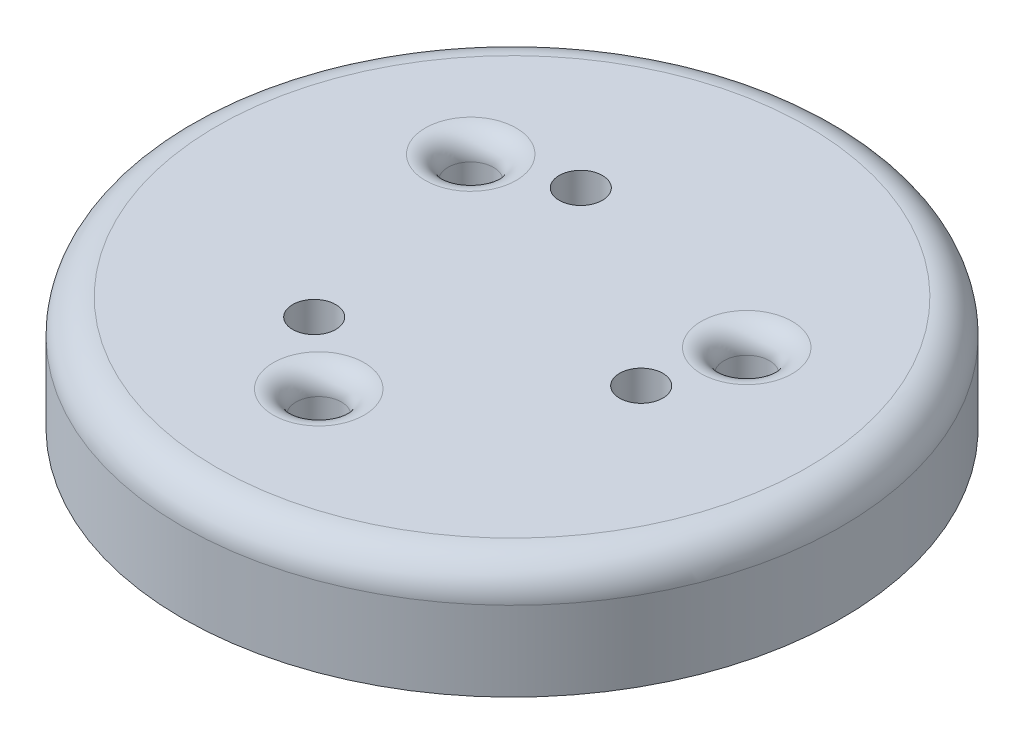
ISO-10303-21;
HEADER;
FILE_DESCRIPTION(('STEP AP214'),'2;1');
FILE_NAME('part.step','',(''),(''),'','','');
FILE_SCHEMA(('AUTOMOTIVE_DESIGN { 1 0 10303 214 1 1 1 1 }'));
ENDSEC;
DATA;
#1=APPLICATION_CONTEXT('core data for automotive mechanical design processes');
#2=APPLICATION_PROTOCOL_DEFINITION('international standard','automotive_design',2000,#1);
#3=PRODUCT_CONTEXT('',#1,'mechanical');
#4=PRODUCT('Part','Part','',(#3));
#5=PRODUCT_RELATED_PRODUCT_CATEGORY('part','',(#4));
#6=PRODUCT_DEFINITION_FORMATION('','',#4);
#7=PRODUCT_DEFINITION_CONTEXT('part definition',#1,'design');
#8=PRODUCT_DEFINITION('design','',#6,#7);
#9=PRODUCT_DEFINITION_SHAPE('','',#8);
#10=(LENGTH_UNIT() NAMED_UNIT(*) SI_UNIT(.MILLI.,.METRE.));
#11=(NAMED_UNIT(*) PLANE_ANGLE_UNIT() SI_UNIT($,.RADIAN.));
#12=(NAMED_UNIT(*) SI_UNIT($,.STERADIAN.) SOLID_ANGLE_UNIT());
#13=UNCERTAINTY_MEASURE_WITH_UNIT(LENGTH_MEASURE(1.E-05),#10,'distance_accuracy_value','');
#14=(GEOMETRIC_REPRESENTATION_CONTEXT(3) GLOBAL_UNCERTAINTY_ASSIGNED_CONTEXT((#13)) GLOBAL_UNIT_ASSIGNED_CONTEXT((#10,
#11,#12)) REPRESENTATION_CONTEXT('',''));
#15=CARTESIAN_POINT('',(0.,0.,0.));
#16=DIRECTION('',(0.,0.,1.));
#17=DIRECTION('',(1.,0.,0.));
#18=AXIS2_PLACEMENT_3D('',#15,#16,#17);
#19=CARTESIAN_POINT('',(-0.747043708746109,-3.5,7.75834555154788));
#20=DIRECTION('',(0.,1.,0.));
#21=DIRECTION('',(0.,0.,1.));
#22=AXIS2_PLACEMENT_3D('',#19,#20,#21);
#23=CYLINDRICAL_SURFACE('',#22,2.40000000000027);
#24=DIRECTION('',(0.,1.,0.));
#25=VECTOR('',#24,1.);
#26=CARTESIAN_POINT('',(-2.94898575184642,-3.75,6.80364599732755));
#27=LINE('',#26,#25);
#28=CARTESIAN_POINT('',(-2.94898575184642,-3.5,6.80364599732755));
#29=VERTEX_POINT('',#28);
#30=CARTESIAN_POINT('',(-2.94898575184642,0.499999999999999,6.80364599732755));
#31=VERTEX_POINT('',#30);
#32=EDGE_CURVE('E115',#29,#31,#27,.T.);
#33=ORIENTED_EDGE('',*,*,#32,.F.);
#34=CARTESIAN_POINT('',(-0.747043708746109,-3.5,7.75834555154788));
#35=DIRECTION('',(0.,-1.,0.));
#36=DIRECTION('',(0.,0.,-1.));
#37=AXIS2_PLACEMENT_3D('',#34,#35,#36);
#38=CIRCLE('',#37,2.40000000000027);
#39=CARTESIAN_POINT('',(-1.85916700968341,-3.5,5.63156823280631));
#40=VERTEX_POINT('',#39);
#41=EDGE_CURVE('E125',#40,#29,#38,.T.);
#42=ORIENTED_EDGE('',*,*,#41,.F.);
#43=DIRECTION('',(0.,1.,0.));
#44=VECTOR('',#43,1.);
#45=CARTESIAN_POINT('',(-1.85916700968341,-3.75,5.63156823280631));
#46=LINE('',#45,#44);
#47=CARTESIAN_POINT('',(-1.85916700968341,0.5,5.63156823280631));
#48=VERTEX_POINT('',#47);
#49=EDGE_CURVE('E117',#48,#40,#46,.F.);
#50=ORIENTED_EDGE('',*,*,#49,.F.);
#51=CARTESIAN_POINT('',(-1.85916700968341,0.5,5.63156823280631));
#52=CARTESIAN_POINT('',(-1.85922399324341,0.476364152434353,5.63160982479117));
#53=CARTESIAN_POINT('',(-1.85710085481181,0.452819889741292,5.6304870864629));
#54=CARTESIAN_POINT('',(-1.84903628313936,0.406824915444279,5.62629371613808));
#55=CARTESIAN_POINT('',(-1.84313653899929,0.38436510889328,5.62324435640042));
#56=CARTESIAN_POINT('',(-1.82807390600251,0.34100557497745,5.6155809974768));
#57=CARTESIAN_POINT('',(-1.81892577377205,0.320099301315876,5.61097407835637));
#58=CARTESIAN_POINT('',(-1.79792325712642,0.279937041822302,5.60061735653464));
#59=CARTESIAN_POINT('',(-1.78605989142544,0.260686831264544,5.59486376930435));
#60=CARTESIAN_POINT('',(-1.75422420588657,0.215699527903121,5.57980940749695));
#61=CARTESIAN_POINT('',(-1.73301416670765,0.190979033457974,5.57008318135522));
#62=CARTESIAN_POINT('',(-1.68693258784869,0.14558463512192,5.54989712614965));
#63=CARTESIAN_POINT('',(-1.66205632415581,0.12491603347054,5.53943635985756));
#64=CARTESIAN_POINT('',(-1.60893980039056,0.0876034545915592,5.51826431890485));
#65=CARTESIAN_POINT('',(-1.58065570854353,0.0710226777879334,5.50755161705734));
#66=CARTESIAN_POINT('',(-1.52166195539404,0.0427147185961175,5.48657434228855));
#67=CARTESIAN_POINT('',(-1.49095727822847,0.0309778578931878,5.47630891279046));
#68=CARTESIAN_POINT('',(-1.43451062158264,0.0147856943271084,5.45876659369856));
#69=CARTESIAN_POINT('',(-1.40911281423456,0.009309628856281,5.45132027870981));
#70=CARTESIAN_POINT('',(-1.3575570049761,0.00191082490389715,5.43713853922088));
#71=CARTESIAN_POINT('',(-1.33139751007746,-4.38044167560807E-06,5.43040465018355));
#72=CARTESIAN_POINT('',(-1.30508833867296,0.,5.42412486981895));
#73=B_SPLINE_CURVE_WITH_KNOTS('',3,(#51,#52,#53,#54,#55,#56,#57,#58,#59,#60,#61,#62,#63,#64,#65,
#66,#67,#68,#69,#70,#71,#72),.UNSPECIFIED.,.F.,.F.,(4,2,2,2,2,2,2,2,2,2,4),(0.,
0.0706410156258254,0.140515381349497,0.210076302649046,0.279870726590837,0.381312836900307,
0.482886819341663,0.585944554177381,0.688795367339838,0.769635628118746,0.850646715821537),.UNSPECIFIED.);
#74=CARTESIAN_POINT('',(-1.30508833867296,0.,5.42412486981895));
#75=VERTEX_POINT('',#74);
#76=EDGE_CURVE('E209',#48,#75,#73,.T.);
#77=ORIENTED_EDGE('',*,*,#76,.T.);
#78=CARTESIAN_POINT('',(-0.747043708746109,0.,7.75834555154788));
#79=DIRECTION('',(0.,-1.,0.));
#80=DIRECTION('',(0.,0.,-1.));
#81=AXIS2_PLACEMENT_3D('',#78,#79,#80);
#82=CIRCLE('',#81,2.40000000000027);
#83=CARTESIAN_POINT('',(-3.11563368180199,0.,7.37132935093037));
#84=VERTEX_POINT('',#83);
#85=EDGE_CURVE('E134',#75,#84,#82,.T.);
#86=ORIENTED_EDGE('',*,*,#85,.T.);
#87=CARTESIAN_POINT('',(-3.11563368180199,0.,7.37132935093037));
#88=CARTESIAN_POINT('',(-3.1101504548428,-9.42250793291496E-06,7.33762045277867));
#89=CARTESIAN_POINT('',(-3.10391373088185,0.00304512877975931,7.30411718324805));
#90=CARTESIAN_POINT('',(-3.09029956792461,0.0147093829560167,7.23850151742084));
#91=CARTESIAN_POINT('',(-3.08292805148638,0.0232909409952881,7.20638294910039));
#92=CARTESIAN_POINT('',(-3.06736894792823,0.0454182683123219,7.14424113943873));
#93=CARTESIAN_POINT('',(-3.05918355755489,0.0589509253297983,7.11421261069181));
#94=CARTESIAN_POINT('',(-3.0423763398629,0.0905630374124857,7.05667117236412));
#95=CARTESIAN_POINT('',(-3.0337533331852,0.108655363864944,7.02916568999036));
#96=CARTESIAN_POINT('',(-3.01585812059544,0.15076645104049,6.97517421708824));
#97=CARTESIAN_POINT('',(-3.00659334910579,0.175159334478642,6.94897580327789));
#98=CARTESIAN_POINT('',(-2.9890261823897,0.228635720743396,6.90151944014422));
#99=CARTESIAN_POINT('',(-2.98072116502593,0.2577058979614,6.88024786228619));
#100=CARTESIAN_POINT('',(-2.96904012572221,0.308226405020023,6.85121993047369));
#101=CARTESIAN_POINT('',(-2.96499330720332,0.32834364364927,6.84140513937073));
#102=CARTESIAN_POINT('',(-2.95809096705968,0.369973446112554,6.82488415821906));
#103=CARTESIAN_POINT('',(-2.95523158105399,0.391481216241625,6.81816787633649));
#104=CARTESIAN_POINT('',(-2.95177890716333,0.427586612901112,6.81010773432918));
#105=CARTESIAN_POINT('',(-2.95074104060405,0.441909733364196,6.80770188368661));
#106=CARTESIAN_POINT('',(-2.94934013629236,0.470816525011653,6.80446330041692));
#107=CARTESIAN_POINT('',(-2.94897955620156,0.48540095196511,6.80363629675652));
#108=CARTESIAN_POINT('',(-2.94898575184642,0.5,6.80364599732756));
#109=B_SPLINE_CURVE_WITH_KNOTS('',3,(#87,#88,#89,#90,#91,#92,#93,#94,#95,#96,#97,#98,#99,#100,
#101,#102,#103,#104,#105,#106,#107,#108),.UNSPECIFIED.,.F.,.F.,(4,2,2,2,2,2,2,2,2,2,4),(0.,
0.102193868356032,0.203871411888512,0.305281603827198,0.406981335110916,0.517364626536822,
0.627438830246796,0.695450836911381,0.763239737075119,0.806825724473092,0.850569568566294),.UNSPECIFIED.);
#110=EDGE_CURVE('E128',#84,#31,#109,.T.);
#111=ORIENTED_EDGE('',*,*,#110,.T.);
#112=EDGE_LOOP('',(#33,#42,#50,#77,#86,#111));
#113=FACE_BOUND('',#112,.T.);
#114=ADVANCED_FACE('F40',(#113),#23,.T.);
#115=CARTESIAN_POINT('',(7.09244619335151,-3.5,-3.23221394626247));
#116=DIRECTION('',(0.,1.,0.));
#117=DIRECTION('',(0.,0.,1.));
#118=AXIS2_PLACEMENT_3D('',#115,#116,#117);
#119=CYLINDRICAL_SURFACE('',#118,2.4);
#120=DIRECTION('',(0.,1.,0.));
#121=VECTOR('',#120,1.);
#122=CARTESIAN_POINT('',(7.36662314796493,-3.75,-0.847926422166663));
#123=LINE('',#122,#121);
#124=CARTESIAN_POINT('',(7.36662314796493,-3.5,-0.847926422166663));
#125=VERTEX_POINT('',#124);
#126=CARTESIAN_POINT('',(7.36662314796493,0.499999999999998,-0.847926422166663));
#127=VERTEX_POINT('',#126);
#128=EDGE_CURVE('E479',#125,#127,#123,.T.);
#129=ORIENTED_EDGE('',*,*,#128,.F.);
#130=CARTESIAN_POINT('',(7.09244619335151,-3.5,-3.23221394626247));
#131=DIRECTION('',(0.,-1.,0.));
#132=DIRECTION('',(0.,0.,-1.));
#133=AXIS2_PLACEMENT_3D('',#130,#131,#132);
#134=CIRCLE('',#133,2.4);
#135=CARTESIAN_POINT('',(5.80666465759774,-3.5,-1.20569825613948));
#136=VERTEX_POINT('',#135);
#137=EDGE_CURVE('E145',#136,#125,#134,.T.);
#138=ORIENTED_EDGE('',*,*,#137,.F.);
#139=DIRECTION('',(0.,1.,0.));
#140=VECTOR('',#139,1.);
#141=CARTESIAN_POINT('',(5.80666465759774,-3.75,-1.20569825613948));
#142=LINE('',#141,#140);
#143=CARTESIAN_POINT('',(5.80666465759774,0.5,-1.20569825613948));
#144=VERTEX_POINT('',#143);
#145=EDGE_CURVE('E476',#144,#136,#142,.F.);
#146=ORIENTED_EDGE('',*,*,#145,.F.);
#147=CARTESIAN_POINT('',(5.80666465759774,0.5,-1.20569825613948));
#148=CARTESIAN_POINT('',(5.80672916909323,0.476364152434356,-1.20566970292135));
#149=CARTESIAN_POINT('',(5.80469527996334,0.452819889741298,-1.20694702557473));
#150=CARTESIAN_POINT('',(5.79703142889834,0.406824915444291,-1.2118344643513));
#151=CARTESIAN_POINT('',(5.79144073383021,0.384365108893295,-1.21541911278361));
#152=CARTESIAN_POINT('',(5.77727275382566,0.341005574977471,-1.22463205614489));
#153=CARTESIAN_POINT('',(5.76870897871895,0.320099301315901,-1.23025111149342));
#154=CARTESIAN_POINT('',(5.74923853619859,0.279937041822333,-1.24326146354108));
#155=CARTESIAN_POINT('',(5.73832410064378,0.260686831264578,-1.25065864599737));
#156=CARTESIAN_POINT('',(5.70936879811137,0.215699527903155,-1.27070197751721));
#157=CARTESIAN_POINT('',(5.69034061960022,0.190979033458005,-1.28420729719056));
#158=CARTESIAN_POINT('',(5.6498181935605,0.145584635121947,-1.31402208752613));
#159=CARTESIAN_POINT('',(5.62832077236206,0.124916033470564,-1.33033518068936));
#160=CARTESIAN_POINT('',(5.58342698516441,0.0876034545915787,-1.36574941915444));
#161=CARTESIAN_POINT('',(5.56000746729779,0.07102267778795,-1.38488781029318));
#162=CARTESIAN_POINT('',(5.5123437378711,0.0427147185961288,-1.42548926180084));
#163=CARTESIAN_POINT('',(5.4881012765622,0.0309778578931968,-1.44694757749218));
#164=CARTESIAN_POINT('',(5.4446858542644,0.0147856943271131,-1.48706065656022));
#165=CARTESIAN_POINT('',(5.42553825264552,0.00930962885628393,-1.5053326454297));
#166=CARTESIAN_POINT('',(5.38747860134901,0.00191082490389742,-1.54289041621574));
#167=CARTESIAN_POINT('',(5.36856713492708,-4.38044167611641E-06,-1.56217825882947));
#168=CARTESIAN_POINT('',(5.3499740998989,0.,-1.58182277943599));
#169=B_SPLINE_CURVE_WITH_KNOTS('',3,(#147,#148,#149,#150,#151,#152,#153,#154,#155,#156,#157,
#158,#159,#160,#161,#162,#163,#164,#165,#166,#167,#168),.UNSPECIFIED.,.F.,.F.,(4,2,2,2,2,2,2,2,
2,2,4),(0.,0.0706410156258162,0.140515381349479,0.210076302649019,0.279870726590799,
0.381312836900282,0.482886819341651,0.585944554177385,0.688795367339857,0.769635628118784,
0.850646715821595),.UNSPECIFIED.);
#170=CARTESIAN_POINT('',(5.3499740998989,0.,-1.58182277943599));
#171=VERTEX_POINT('',#170);
#172=EDGE_CURVE('E242',#144,#171,#169,.T.);
#173=ORIENTED_EDGE('',*,*,#172,.T.);
#174=CARTESIAN_POINT('',(7.09244619335151,0.,-3.23221394626247));
#175=DIRECTION('',(0.,-1.,0.));
#176=DIRECTION('',(0.,0.,-1.));
#177=AXIS2_PLACEMENT_3D('',#174,#175,#176);
#178=CIRCLE('',#177,2.4);
#179=CARTESIAN_POINT('',(7.94157531846838,0.,-0.987446758138442));
#180=VERTEX_POINT('',#179);
#181=EDGE_CURVE('E150',#171,#180,#178,.T.);
#182=ORIENTED_EDGE('',*,*,#181,.T.);
#183=CARTESIAN_POINT('',(7.94157531846838,0.,-0.987446758138442));
#184=CARTESIAN_POINT('',(7.90964094285583,-9.42250793316037E-06,-0.97534092290397));
#185=CARTESIAN_POINT('',(7.87750789835199,0.00304512877975952,-0.963990449525229));
#186=CARTESIAN_POINT('',(7.81387598338077,0.0147093829560188,-0.942972827583861));
#187=CARTESIAN_POINT('',(7.78237472906296,0.0232909409952914,-0.933297463923552));
#188=CARTESIAN_POINT('',(7.72077879147973,0.0454182683123283,-0.915701138034194));
#189=CARTESIAN_POINT('',(7.69068062755995,0.0589509253298065,-0.907775629663939));
#190=CARTESIAN_POINT('',(7.63244467135187,0.0905630374124975,-0.89356038798829));
#191=CARTESIAN_POINT('',(7.60431272153399,0.108655363864958,-0.887275389641311));
#192=CARTESIAN_POINT('',(7.54860712811813,0.15076645104051,-0.875777361899105));
#193=CARTESIAN_POINT('',(7.52128625047468,0.175159334478666,-0.870701682464221));
#194=CARTESIAN_POINT('',(7.47140425107164,0.228635720743431,-0.862187113546037));
#195=CARTESIAN_POINT('',(7.44883001558611,0.257705897961442,-0.858743680632926));
#196=CARTESIAN_POINT('',(7.41785056956531,0.308226405020069,-0.8543457915063));
#197=CARTESIAN_POINT('',(7.40732730187786,0.328343643649311,-0.852943043596693));
#198=CARTESIAN_POINT('',(7.38956854243325,0.369973446112587,-0.850660154930812));
#199=CARTESIAN_POINT('',(7.38232237870113,0.391481216241655,-0.849778314909683));
#200=CARTESIAN_POINT('',(7.37361575401936,0.427586612901133,-0.848738347206322));
#201=CARTESIAN_POINT('',(7.37101329296554,0.441909733364212,-0.848434240691103));
#202=CARTESIAN_POINT('',(7.36750814542588,0.470816525011661,-0.848028167778463));
#203=CARTESIAN_POINT('',(7.36661164920155,0.485400951965114,-0.847926937466996));
#204=CARTESIAN_POINT('',(7.36662314796493,0.5,-0.847926422166664));
#205=B_SPLINE_CURVE_WITH_KNOTS('',3,(#183,#184,#185,#186,#187,#188,#189,#190,#191,#192,#193,
#194,#195,#196,#197,#198,#199,#200,#201,#202,#203,#204),.UNSPECIFIED.,.F.,.F.,(4,2,2,2,2,2,2,2,
2,2,4),(0.,0.102193868356048,0.203871411888543,0.305281603827245,0.406981335110977,
0.517364626536908,0.627438830246908,0.695450836911478,0.763239737075204,0.806825724473164,
0.850569568566353),.UNSPECIFIED.);
#206=EDGE_CURVE('E248',#180,#127,#205,.T.);
#207=ORIENTED_EDGE('',*,*,#206,.T.);
#208=EDGE_LOOP('',(#129,#138,#146,#173,#182,#207));
#209=FACE_BOUND('',#208,.T.);
#210=ADVANCED_FACE('F260',(#209),#119,.T.);
#211=CARTESIAN_POINT('',(-6.3454024846054,-3.5,-4.52613160528542));
#212=DIRECTION('',(0.,1.,0.));
#213=DIRECTION('',(0.,0.,1.));
#214=AXIS2_PLACEMENT_3D('',#211,#212,#213);
#215=CYLINDRICAL_SURFACE('',#214,2.40000000000008);
#216=DIRECTION('',(0.,1.,0.));
#217=VECTOR('',#216,1.);
#218=CARTESIAN_POINT('',(-4.41763739611885,-2.25,-5.95571957516094));
#219=LINE('',#218,#217);
#220=CARTESIAN_POINT('',(-4.41763739611885,-3.5,-5.95571957516094));
#221=VERTEX_POINT('',#220);
#222=CARTESIAN_POINT('',(-4.41763739611885,0.5,-5.95571957516094));
#223=VERTEX_POINT('',#222);
#224=EDGE_CURVE('E63',#221,#223,#219,.T.);
#225=ORIENTED_EDGE('',*,*,#224,.F.);
#226=CARTESIAN_POINT('',(-6.3454024846054,-3.5,-4.52613160528542));
#227=DIRECTION('',(0.,-1.,0.));
#228=DIRECTION('',(0.,0.,1.));
#229=AXIS2_PLACEMENT_3D('',#226,#227,#228);
#230=CIRCLE('',#229,2.40000000000008);
#231=CARTESIAN_POINT('',(-3.94749764791417,-3.5,-4.42586997666704));
#232=VERTEX_POINT('',#231);
#233=EDGE_CURVE('E137',#232,#221,#230,.T.);
#234=ORIENTED_EDGE('',*,*,#233,.F.);
#235=DIRECTION('',(0.,1.,0.));
#236=VECTOR('',#235,1.);
#237=CARTESIAN_POINT('',(-3.94749764791417,-2.25,-4.42586997666704));
#238=LINE('',#237,#236);
#239=CARTESIAN_POINT('',(-3.94749764791417,0.5,-4.42586997666704));
#240=VERTEX_POINT('',#239);
#241=EDGE_CURVE('E55',#240,#232,#238,.F.);
#242=ORIENTED_EDGE('',*,*,#241,.F.);
#243=CARTESIAN_POINT('',(-3.94749764791417,0.5,-4.42586997666704));
#244=CARTESIAN_POINT('',(-3.94750517584966,0.476364152434354,-4.42594012187004));
#245=CARTESIAN_POINT('',(-3.94759442515137,0.452819889741294,-4.42354006088838));
#246=CARTESIAN_POINT('',(-3.94799514575883,0.406824915444284,-4.41445925178699));
#247=CARTESIAN_POINT('',(-3.94830419483077,0.384365108893288,-4.40782524361703));
#248=CARTESIAN_POINT('',(-3.94919884782299,0.34100557497746,-4.39094894133213));
#249=CARTESIAN_POINT('',(-3.94978320494674,0.320099301315888,-4.38072296686315));
#250=CARTESIAN_POINT('',(-3.95131527907202,0.279937041822317,-4.35735589299377));
#251=CARTESIAN_POINT('',(-3.95226420921818,0.26068683126456,-4.34420512330719));
#252=CARTESIAN_POINT('',(-3.95514459222464,0.215699527903138,-4.30910742997994));
#253=CARTESIAN_POINT('',(-3.95732645289241,0.190979033457989,-4.28587588416486));
#254=CARTESIAN_POINT('',(-3.96288560571167,0.145584635121933,-4.23587503862371));
#255=CARTESIAN_POINT('',(-3.96626444820611,0.124916033470551,-4.20910117916839));
#256=CARTESIAN_POINT('',(-3.97448718477372,0.0876034545915679,-4.1525148997506));
#257=CARTESIAN_POINT('',(-3.97935175875413,0.0710226777879407,-4.12266380676435));
#258=CARTESIAN_POINT('',(-3.99068178247693,0.0427147185961223,-4.06108508048791));
#259=CARTESIAN_POINT('',(-3.99714399833362,0.0309778578931916,-4.02936133529847));
#260=CARTESIAN_POINT('',(-4.01017523268165,0.0147856943271102,-3.97170593713853));
#261=CARTESIAN_POINT('',(-4.01642543841085,0.00930962885628205,-3.9459876332803));
#262=CARTESIAN_POINT('',(-4.02992159637281,0.00191082490389709,-3.89424812300533));
#263=CARTESIAN_POINT('',(-4.03716962484954,-4.38044167599041E-06,-3.86822639135427));
#264=CARTESIAN_POINT('',(-4.04488576122586,0.,-3.84230209038315));
#265=B_SPLINE_CURVE_WITH_KNOTS('',3,(#243,#244,#245,#246,#247,#248,#249,#250,#251,#252,#253,
#254,#255,#256,#257,#258,#259,#260,#261,#262,#263,#264),.UNSPECIFIED.,.F.,.F.,(4,2,2,2,2,2,2,2,
2,2,4),(0.,0.070641015625821,0.140515381349488,0.210076302649033,0.279870726590819,
0.381312836900295,0.482886819341658,0.585944554177385,0.688795367339848,0.769635628118766,
0.850646715821566),.UNSPECIFIED.);
#266=CARTESIAN_POINT('',(-4.04488576122586,0.,-3.84230209038315));
#267=VERTEX_POINT('',#266);
#268=EDGE_CURVE('E254',#240,#267,#265,.T.);
#269=ORIENTED_EDGE('',*,*,#268,.T.);
#270=CARTESIAN_POINT('',(-6.3454024846054,0.,-4.52613160528542));
#271=DIRECTION('',(0.,-1.,0.));
#272=DIRECTION('',(0.,0.,1.));
#273=AXIS2_PLACEMENT_3D('',#270,#271,#272);
#274=CIRCLE('',#273,2.40000000000008);
#275=CARTESIAN_POINT('',(-4.82594163666666,0.,-6.383882592792));
#276=VERTEX_POINT('',#275);
#277=EDGE_CURVE('E133',#267,#276,#274,.T.);
#278=ORIENTED_EDGE('',*,*,#277,.T.);
#279=CARTESIAN_POINT('',(-4.82594163666666,0.,-6.383882592792));
#280=CARTESIAN_POINT('',(-4.7994904880133,-9.42250793285505E-06,-6.36227952987477));
#281=CARTESIAN_POINT('',(-4.77359416747042,0.00304512877975951,-6.34012673372288));
#282=CARTESIAN_POINT('',(-4.72357641545645,0.0147093829560176,-6.29552868983704));
#283=CARTESIAN_POINT('',(-4.69944667757686,0.0232909409952896,-6.2730854851769));
#284=CARTESIAN_POINT('',(-4.6534098435518,0.045418268312325,-6.22854000140459));
#285=CARTESIAN_POINT('',(-4.63149707000536,0.0589509253298024,-6.20643698102792));
#286=CARTESIAN_POINT('',(-4.59006833148927,0.0905630374124917,-6.16311078437588));
#287=CARTESIAN_POINT('',(-4.57055938834911,0.108655363864951,-6.1418903003491));
#288=CARTESIAN_POINT('',(-4.53274900752301,0.1507664510405,-6.09939685518918));
#289=CARTESIAN_POINT('',(-4.51469290136921,0.175159334478654,-6.07827412081371));
#290=CARTESIAN_POINT('',(-4.48237806868227,0.228635720743413,-6.03933232659822));
#291=CARTESIAN_POINT('',(-4.46810885056053,0.25770589796142,-6.0215041816533));
#292=CARTESIAN_POINT('',(-4.44881044384344,0.308226405020044,-5.99687413896743));
#293=CARTESIAN_POINT('',(-4.44233399467489,0.328343643649289,-5.98846209577408));
#294=CARTESIAN_POINT('',(-4.43147757537392,0.369973446112569,-5.97422400328829));
#295=CARTESIAN_POINT('',(-4.42709079764749,0.391481216241638,-5.96838956142685));
#296=CARTESIAN_POINT('',(-4.42183684685638,0.427586612901121,-5.9613693871229));
#297=CARTESIAN_POINT('',(-4.42027225236183,0.441909733364202,-5.95926764299555));
#298=CARTESIAN_POINT('',(-4.41816800913386,0.470816525011656,-5.95643513263851));
#299=CARTESIAN_POINT('',(-4.41763209300033,0.485400951965112,-5.95570935928957));
#300=CARTESIAN_POINT('',(-4.41763739611885,0.5,-5.95571957516094));
#301=B_SPLINE_CURVE_WITH_KNOTS('',3,(#279,#280,#281,#282,#283,#284,#285,#286,#287,#288,#289,
#290,#291,#292,#293,#294,#295,#296,#297,#298,#299,#300),.UNSPECIFIED.,.F.,.F.,(4,2,2,2,2,2,2,2,
2,2,4),(0.,0.102193868356038,0.203871411888527,0.305281603827221,0.406981335110945,
0.517364626536863,0.627438830246849,0.695450836911427,0.763239737075158,0.806825724473126,
0.850569568566322),.UNSPECIFIED.);
#302=EDGE_CURVE('E438',#276,#223,#301,.T.);
#303=ORIENTED_EDGE('',*,*,#302,.T.);
#304=EDGE_LOOP('',(#225,#234,#242,#269,#278,#303));
#305=FACE_BOUND('',#304,.T.);
#306=ADVANCED_FACE('F265',(#305),#215,.T.);
#307=CARTESIAN_POINT('',(6.22621686307341,5.,0.544723392172865));
#308=DIRECTION('',(0.,-1.,0.));
#309=DIRECTION('',(0.,0.,-1.));
#310=AXIS2_PLACEMENT_3D('',#307,#308,#309);
#311=CYLINDRICAL_SURFACE('',#310,0.949999999999999);
#312=CARTESIAN_POINT('',(6.22621686307341,5.,0.544723392172865));
#313=DIRECTION('',(0.,1.,0.));
#314=DIRECTION('',(0.,0.,1.));
#315=AXIS2_PLACEMENT_3D('',#312,#313,#314);
#316=CIRCLE('',#315,0.949999999999999);
#317=CARTESIAN_POINT('',(6.22621686307341,5.,1.49472339217286));
#318=VERTEX_POINT('',#317);
#319=EDGE_CURVE('E171',#318,#318,#316,.T.);
#320=ORIENTED_EDGE('',*,*,#319,.T.);
#321=EDGE_LOOP('',(#320));
#322=FACE_BOUND('',#321,.T.);
#323=CARTESIAN_POINT('',(6.22621686307341,2.,0.544723392172865));
#324=DIRECTION('',(0.,-1.,0.));
#325=DIRECTION('',(0.,0.,-1.));
#326=AXIS2_PLACEMENT_3D('',#323,#324,#325);
#327=CIRCLE('',#326,0.949999999999999);
#328=CARTESIAN_POINT('',(6.22621686307341,2.,-0.405276607827134));
#329=VERTEX_POINT('',#328);
#330=EDGE_CURVE('E156',#329,#329,#327,.T.);
#331=ORIENTED_EDGE('',*,*,#330,.T.);
#332=EDGE_LOOP('',(#331));
#333=FACE_BOUND('',#332,.T.);
#334=ADVANCED_FACE('F300',(#322,#333),#311,.F.);
#335=CARTESIAN_POINT('',(-2.6413641358794,5.,-5.66442366897905));
#336=DIRECTION('',(0.,-1.,0.));
#337=DIRECTION('',(0.,0.,-1.));
#338=AXIS2_PLACEMENT_3D('',#335,#336,#337);
#339=CYLINDRICAL_SURFACE('',#338,0.950000000000001);
#340=CARTESIAN_POINT('',(-2.6413641358794,5.,-5.66442366897905));
#341=DIRECTION('',(0.,1.,0.));
#342=DIRECTION('',(0.,0.,1.));
#343=AXIS2_PLACEMENT_3D('',#340,#341,#342);
#344=CIRCLE('',#343,0.950000000000001);
#345=CARTESIAN_POINT('',(-2.6413641358794,5.,-4.71442366897905));
#346=VERTEX_POINT('',#345);
#347=EDGE_CURVE('E168',#346,#346,#344,.T.);
#348=ORIENTED_EDGE('',*,*,#347,.T.);
#349=EDGE_LOOP('',(#348));
#350=FACE_BOUND('',#349,.T.);
#351=CARTESIAN_POINT('',(-2.6413641358794,2.,-5.66442366897905));
#352=DIRECTION('',(0.,-1.,0.));
#353=DIRECTION('',(0.,0.,-1.));
#354=AXIS2_PLACEMENT_3D('',#351,#352,#353);
#355=CIRCLE('',#354,0.950000000000001);
#356=CARTESIAN_POINT('',(-2.6413641358794,2.,-6.61442366897905));
#357=VERTEX_POINT('',#356);
#358=EDGE_CURVE('E160',#357,#357,#355,.T.);
#359=ORIENTED_EDGE('',*,*,#358,.T.);
#360=EDGE_LOOP('',(#359));
#361=FACE_BOUND('',#360,.T.);
#362=ADVANCED_FACE('F296',(#350,#361),#339,.F.);
#363=CARTESIAN_POINT('',(-3.58485272719406,5.,5.11970027680618));
#364=DIRECTION('',(0.,-1.,0.));
#365=DIRECTION('',(0.,0.,-1.));
#366=AXIS2_PLACEMENT_3D('',#363,#364,#365);
#367=CYLINDRICAL_SURFACE('',#366,0.950000000000001);
#368=CARTESIAN_POINT('',(-3.58485272719406,5.,5.11970027680618));
#369=DIRECTION('',(0.,1.,0.));
#370=DIRECTION('',(0.,0.,1.));
#371=AXIS2_PLACEMENT_3D('',#368,#369,#370);
#372=CIRCLE('',#371,0.950000000000001);
#373=CARTESIAN_POINT('',(-3.58485272719406,5.,6.06970027680618));
#374=VERTEX_POINT('',#373);
#375=EDGE_CURVE('E165',#374,#374,#372,.T.);
#376=ORIENTED_EDGE('',*,*,#375,.T.);
#377=EDGE_LOOP('',(#376));
#378=FACE_BOUND('',#377,.T.);
#379=CARTESIAN_POINT('',(-3.58485272719406,2.,5.11970027680618));
#380=DIRECTION('',(0.,-1.,0.));
#381=DIRECTION('',(0.,0.,-1.));
#382=AXIS2_PLACEMENT_3D('',#379,#380,#381);
#383=CIRCLE('',#382,0.950000000000001);
#384=CARTESIAN_POINT('',(-3.58485272719406,2.,4.16970027680618));
#385=VERTEX_POINT('',#384);
#386=EDGE_CURVE('E164',#385,#385,#383,.T.);
#387=ORIENTED_EDGE('',*,*,#386,.T.);
#388=EDGE_LOOP('',(#387));
#389=FACE_BOUND('',#388,.T.);
#390=ADVANCED_FACE('F292',(#378,#389),#367,.F.);
#391=CARTESIAN_POINT('',(0.,5.,0.));
#392=DIRECTION('',(0.,1.,0.));
#393=DIRECTION('',(0.,0.,1.));
#394=AXIS2_PLACEMENT_3D('',#391,#392,#393);
#395=PLANE('',#394);
#396=CARTESIAN_POINT('',(-0.747043708746109,5.,7.75834555154788));
#397=DIRECTION('',(0.,1.,0.));
#398=DIRECTION('',(0.,0.,1.));
#399=AXIS2_PLACEMENT_3D('',#396,#397,#398);
#400=CIRCLE('',#399,2.);
#401=CARTESIAN_POINT('',(-0.747043708746109,5.,9.75834555154788));
#402=VERTEX_POINT('',#401);
#403=EDGE_CURVE('E441',#402,#402,#400,.F.);
#404=ORIENTED_EDGE('',*,*,#403,.T.);
#405=EDGE_LOOP('',(#404));
#406=FACE_BOUND('',#405,.T.);
#407=CARTESIAN_POINT('',(-6.3454024846054,5.,-4.52613160528542));
#408=DIRECTION('',(0.,1.,0.));
#409=DIRECTION('',(0.,0.,1.));
#410=AXIS2_PLACEMENT_3D('',#407,#408,#409);
#411=CIRCLE('',#410,2.);
#412=CARTESIAN_POINT('',(-6.3454024846054,5.,-2.52613160528542));
#413=VERTEX_POINT('',#412);
#414=EDGE_CURVE('E437',#413,#413,#411,.F.);
#415=ORIENTED_EDGE('',*,*,#414,.T.);
#416=EDGE_LOOP('',(#415));
#417=FACE_BOUND('',#416,.T.);
#418=CARTESIAN_POINT('',(7.09244619335151,5.,-3.23221394626247));
#419=DIRECTION('',(0.,1.,0.));
#420=DIRECTION('',(0.,0.,1.));
#421=AXIS2_PLACEMENT_3D('',#418,#419,#420);
#422=CIRCLE('',#421,2.);
#423=CARTESIAN_POINT('',(7.09244619335151,5.,-1.23221394626247));
#424=VERTEX_POINT('',#423);
#425=EDGE_CURVE('E435',#424,#424,#422,.F.);
#426=ORIENTED_EDGE('',*,*,#425,.T.);
#427=EDGE_LOOP('',(#426));
#428=FACE_BOUND('',#427,.T.);
#429=CARTESIAN_POINT('',(0.,5.,0.));
#430=DIRECTION('',(0.,1.,0.));
#431=DIRECTION('',(0.,0.,1.));
#432=AXIS2_PLACEMENT_3D('',#429,#430,#431);
#433=CIRCLE('',#432,13.);
#434=CARTESIAN_POINT('',(0.,5.,13.));
#435=VERTEX_POINT('',#434);
#436=EDGE_CURVE('E177',#435,#435,#433,.T.);
#437=ORIENTED_EDGE('',*,*,#436,.T.);
#438=EDGE_LOOP('',(#437));
#439=FACE_BOUND('',#438,.T.);
#440=ORIENTED_EDGE('',*,*,#347,.F.);
#441=EDGE_LOOP('',(#440));
#442=FACE_BOUND('',#441,.T.);
#443=ORIENTED_EDGE('',*,*,#319,.F.);
#444=EDGE_LOOP('',(#443));
#445=FACE_BOUND('',#444,.T.);
#446=ORIENTED_EDGE('',*,*,#375,.F.);
#447=EDGE_LOOP('',(#446));
#448=FACE_BOUND('',#447,.T.);
#449=ADVANCED_FACE('F295',(#406,#417,#428,#439,#442,#445,#448),#395,.T.);
#450=CARTESIAN_POINT('',(0.,0.,0.));
#451=DIRECTION('',(0.,1.,0.));
#452=DIRECTION('',(0.,0.,1.));
#453=AXIS2_PLACEMENT_3D('',#450,#451,#452);
#454=PLANE('',#453);
#455=ORIENTED_EDGE('',*,*,#85,.F.);
#456=CARTESIAN_POINT('',(-3.58485272719406,0.,5.11970027680618));
#457=DIRECTION('',(0.,1.,0.));
#458=DIRECTION('',(0.,0.,1.));
#459=AXIS2_PLACEMENT_3D('',#456,#457,#458);
#460=CIRCLE('',#459,2.3);
#461=EDGE_CURVE('E202',#75,#84,#460,.T.);
#462=ORIENTED_EDGE('',*,*,#461,.T.);
#463=EDGE_LOOP('',(#455,#462));
#464=FACE_BOUND('',#463,.T.);
#465=ORIENTED_EDGE('',*,*,#277,.F.);
#466=CARTESIAN_POINT('',(-2.6413641358794,0.,-5.66442366897905));
#467=DIRECTION('',(0.,1.,0.));
#468=DIRECTION('',(0.,0.,1.));
#469=AXIS2_PLACEMENT_3D('',#466,#467,#468);
#470=CIRCLE('',#469,2.3);
#471=EDGE_CURVE('E198',#267,#276,#470,.T.);
#472=ORIENTED_EDGE('',*,*,#471,.T.);
#473=EDGE_LOOP('',(#465,#472));
#474=FACE_BOUND('',#473,.T.);
#475=ORIENTED_EDGE('',*,*,#181,.F.);
#476=CARTESIAN_POINT('',(6.22621686307341,0.,0.544723392172864));
#477=DIRECTION('',(0.,1.,0.));
#478=DIRECTION('',(0.,0.,1.));
#479=AXIS2_PLACEMENT_3D('',#476,#477,#478);
#480=CIRCLE('',#479,2.3);
#481=EDGE_CURVE('E200',#171,#180,#480,.T.);
#482=ORIENTED_EDGE('',*,*,#481,.T.);
#483=EDGE_LOOP('',(#475,#482));
#484=FACE_BOUND('',#483,.T.);
#485=CARTESIAN_POINT('',(0.,0.,0.));
#486=DIRECTION('',(0.,1.,0.));
#487=DIRECTION('',(0.,0.,1.));
#488=AXIS2_PLACEMENT_3D('',#485,#486,#487);
#489=CIRCLE('',#488,14.5);
#490=CARTESIAN_POINT('',(0.,0.,14.5));
#491=VERTEX_POINT('',#490);
#492=EDGE_CURVE('E174',#491,#491,#489,.T.);
#493=ORIENTED_EDGE('',*,*,#492,.F.);
#494=EDGE_LOOP('',(#493));
#495=FACE_BOUND('',#494,.T.);
#496=ADVANCED_FACE('F307',(#464,#474,#484,#495),#454,.F.);
#497=CARTESIAN_POINT('',(0.,5.,0.));
#498=DIRECTION('',(0.,-1.,0.));
#499=DIRECTION('',(0.,0.,-1.));
#500=AXIS2_PLACEMENT_3D('',#497,#498,#499);
#501=CYLINDRICAL_SURFACE('',#500,14.5);
#502=CARTESIAN_POINT('',(0.,3.5,0.));
#503=DIRECTION('',(0.,1.,0.));
#504=DIRECTION('',(0.,0.,1.));
#505=AXIS2_PLACEMENT_3D('',#502,#503,#504);
#506=CIRCLE('',#505,14.5);
#507=CARTESIAN_POINT('',(0.,3.5,14.5));
#508=VERTEX_POINT('',#507);
#509=EDGE_CURVE('E153',#508,#508,#506,.F.);
#510=ORIENTED_EDGE('',*,*,#509,.T.);
#511=EDGE_LOOP('',(#510));
#512=FACE_BOUND('',#511,.T.);
#513=ORIENTED_EDGE('',*,*,#492,.T.);
#514=EDGE_LOOP('',(#513));
#515=FACE_BOUND('',#514,.T.);
#516=ADVANCED_FACE('F310',(#512,#515),#501,.T.);
#517=CARTESIAN_POINT('',(0.,3.5,0.));
#518=DIRECTION('',(0.,1.,0.));
#519=DIRECTION('',(0.,0.,1.));
#520=AXIS2_PLACEMENT_3D('',#517,#518,#519);
#521=TOROIDAL_SURFACE('',#520,13.,1.5);
#522=ORIENTED_EDGE('',*,*,#509,.F.);
#523=EDGE_LOOP('',(#522));
#524=FACE_BOUND('',#523,.T.);
#525=ORIENTED_EDGE('',*,*,#436,.F.);
#526=EDGE_LOOP('',(#525));
#527=FACE_BOUND('',#526,.T.);
#528=ADVANCED_FACE('F231',(#524,#527),#521,.T.);
#529=CARTESIAN_POINT('',(-3.58485272719406,-10.,5.11970027680618));
#530=DIRECTION('',(0.,1.,0.));
#531=DIRECTION('',(0.,0.,1.));
#532=AXIS2_PLACEMENT_3D('',#529,#530,#531);
#533=CYLINDRICAL_SURFACE('',#532,1.8);
#534=CARTESIAN_POINT('',(-3.58485272719406,2.,5.11970027680618));
#535=DIRECTION('',(0.,-1.,0.));
#536=DIRECTION('',(0.,0.,-1.));
#537=AXIS2_PLACEMENT_3D('',#534,#535,#536);
#538=CIRCLE('',#537,1.8);
#539=CARTESIAN_POINT('',(-3.58485272719406,2.,3.31970027680618));
#540=VERTEX_POINT('',#539);
#541=EDGE_CURVE('E161',#540,#540,#538,.T.);
#542=ORIENTED_EDGE('',*,*,#541,.F.);
#543=EDGE_LOOP('',(#542));
#544=FACE_BOUND('',#543,.T.);
#545=CARTESIAN_POINT('',(-3.58485272719406,0.5,5.11970027680618));
#546=DIRECTION('',(0.,1.,0.));
#547=DIRECTION('',(0.,0.,1.));
#548=AXIS2_PLACEMENT_3D('',#545,#546,#547);
#549=CIRCLE('',#548,1.8);
#550=EDGE_CURVE('E121',#31,#48,#549,.F.);
#551=ORIENTED_EDGE('',*,*,#550,.T.);
#552=ORIENTED_EDGE('',*,*,#49,.T.);
#553=CARTESIAN_POINT('',(-3.58485272719406,-3.5,5.11970027680618));
#554=DIRECTION('',(0.,-1.,0.));
#555=DIRECTION('',(0.,0.,-1.));
#556=AXIS2_PLACEMENT_3D('',#553,#554,#555);
#557=CIRCLE('',#556,1.8);
#558=EDGE_CURVE('E111',#29,#40,#557,.F.);
#559=ORIENTED_EDGE('',*,*,#558,.F.);
#560=ORIENTED_EDGE('',*,*,#32,.T.);
#561=EDGE_LOOP('',(#551,#552,#559,#560));
#562=FACE_BOUND('',#561,.T.);
#563=ADVANCED_FACE('F114',(#544,#562),#533,.F.);
#564=CARTESIAN_POINT('',(-3.58485272719406,2.,5.11970027680618));
#565=DIRECTION('',(0.,-1.,0.));
#566=DIRECTION('',(0.,0.,-1.));
#567=AXIS2_PLACEMENT_3D('',#564,#565,#566);
#568=PLANE('',#567);
#569=ORIENTED_EDGE('',*,*,#386,.F.);
#570=EDGE_LOOP('',(#569));
#571=FACE_BOUND('',#570,.T.);
#572=ORIENTED_EDGE('',*,*,#541,.T.);
#573=EDGE_LOOP('',(#572));
#574=FACE_BOUND('',#573,.T.);
#575=ADVANCED_FACE('F284',(#571,#574),#568,.T.);
#576=CARTESIAN_POINT('',(-2.6413641358794,-3.5,-5.66442366897905));
#577=DIRECTION('',(0.,1.,0.));
#578=DIRECTION('',(0.,0.,1.));
#579=AXIS2_PLACEMENT_3D('',#576,#577,#578);
#580=CYLINDRICAL_SURFACE('',#579,1.8);
#581=CARTESIAN_POINT('',(-2.6413641358794,2.,-5.66442366897905));
#582=DIRECTION('',(0.,-1.,0.));
#583=DIRECTION('',(0.,0.,-1.));
#584=AXIS2_PLACEMENT_3D('',#581,#582,#583);
#585=CIRCLE('',#584,1.8);
#586=CARTESIAN_POINT('',(-2.6413641358794,2.,-7.46442366897905));
#587=VERTEX_POINT('',#586);
#588=EDGE_CURVE('E157',#587,#587,#585,.T.);
#589=ORIENTED_EDGE('',*,*,#588,.F.);
#590=EDGE_LOOP('',(#589));
#591=FACE_BOUND('',#590,.T.);
#592=CARTESIAN_POINT('',(-2.6413641358794,0.5,-5.66442366897905));
#593=DIRECTION('',(0.,1.,0.));
#594=DIRECTION('',(0.,0.,1.));
#595=AXIS2_PLACEMENT_3D('',#592,#593,#594);
#596=CIRCLE('',#595,1.8);
#597=EDGE_CURVE('E207',#223,#240,#596,.F.);
#598=ORIENTED_EDGE('',*,*,#597,.T.);
#599=ORIENTED_EDGE('',*,*,#241,.T.);
#600=CARTESIAN_POINT('',(-2.6413641358794,-3.5,-5.66442366897905));
#601=DIRECTION('',(0.,1.,0.));
#602=DIRECTION('',(0.,0.,1.));
#603=AXIS2_PLACEMENT_3D('',#600,#601,#602);
#604=CIRCLE('',#603,1.8);
#605=EDGE_CURVE('E122',#232,#221,#604,.F.);
#606=ORIENTED_EDGE('',*,*,#605,.T.);
#607=ORIENTED_EDGE('',*,*,#224,.T.);
#608=EDGE_LOOP('',(#598,#599,#606,#607));
#609=FACE_BOUND('',#608,.T.);
#610=ADVANCED_FACE('F280',(#591,#609),#580,.F.);
#611=CARTESIAN_POINT('',(-2.6413641358794,2.,-5.66442366897905));
#612=DIRECTION('',(0.,-1.,0.));
#613=DIRECTION('',(0.,0.,-1.));
#614=AXIS2_PLACEMENT_3D('',#611,#612,#613);
#615=PLANE('',#614);
#616=ORIENTED_EDGE('',*,*,#358,.F.);
#617=EDGE_LOOP('',(#616));
#618=FACE_BOUND('',#617,.T.);
#619=ORIENTED_EDGE('',*,*,#588,.T.);
#620=EDGE_LOOP('',(#619));
#621=FACE_BOUND('',#620,.T.);
#622=ADVANCED_FACE('F276',(#618,#621),#615,.T.);
#623=CARTESIAN_POINT('',(6.22621686307341,-1.2E-05,0.544723392172864));
#624=DIRECTION('',(0.,1.,0.));
#625=DIRECTION('',(0.,0.,1.));
#626=AXIS2_PLACEMENT_3D('',#623,#624,#625);
#627=CYLINDRICAL_SURFACE('',#626,1.8);
#628=CARTESIAN_POINT('',(6.22621686307341,2.,0.544723392172864));
#629=DIRECTION('',(0.,-1.,0.));
#630=DIRECTION('',(0.,0.,-1.));
#631=AXIS2_PLACEMENT_3D('',#628,#629,#630);
#632=CIRCLE('',#631,1.8);
#633=CARTESIAN_POINT('',(6.22621686307341,2.,-1.25527660782713));
#634=VERTEX_POINT('',#633);
#635=EDGE_CURVE('E149',#634,#634,#632,.T.);
#636=ORIENTED_EDGE('',*,*,#635,.F.);
#637=EDGE_LOOP('',(#636));
#638=FACE_BOUND('',#637,.T.);
#639=CARTESIAN_POINT('',(6.22621686307341,0.5,0.544723392172864));
#640=DIRECTION('',(0.,1.,0.));
#641=DIRECTION('',(0.,0.,1.));
#642=AXIS2_PLACEMENT_3D('',#639,#640,#641);
#643=CIRCLE('',#642,1.8);
#644=EDGE_CURVE('E204',#127,#144,#643,.F.);
#645=ORIENTED_EDGE('',*,*,#644,.T.);
#646=ORIENTED_EDGE('',*,*,#145,.T.);
#647=CARTESIAN_POINT('',(6.22621686307341,-3.5,0.544723392172865));
#648=DIRECTION('',(0.,-1.,0.));
#649=DIRECTION('',(0.,0.,-1.));
#650=AXIS2_PLACEMENT_3D('',#647,#648,#649);
#651=CIRCLE('',#650,1.8);
#652=EDGE_CURVE('E130',#125,#136,#651,.F.);
#653=ORIENTED_EDGE('',*,*,#652,.F.);
#654=ORIENTED_EDGE('',*,*,#128,.T.);
#655=EDGE_LOOP('',(#645,#646,#653,#654));
#656=FACE_BOUND('',#655,.T.);
#657=ADVANCED_FACE('F272',(#638,#656),#627,.F.);
#658=CARTESIAN_POINT('',(6.22621686307341,2.,0.544723392172864));
#659=DIRECTION('',(0.,-1.,0.));
#660=DIRECTION('',(0.,0.,-1.));
#661=AXIS2_PLACEMENT_3D('',#658,#659,#660);
#662=PLANE('',#661);
#663=ORIENTED_EDGE('',*,*,#330,.F.);
#664=EDGE_LOOP('',(#663));
#665=FACE_BOUND('',#664,.T.);
#666=ORIENTED_EDGE('',*,*,#635,.T.);
#667=EDGE_LOOP('',(#666));
#668=FACE_BOUND('',#667,.T.);
#669=ADVANCED_FACE('F268',(#665,#668),#662,.T.);
#670=CARTESIAN_POINT('',(7.09244619335151,-3.5,-3.23221394626247));
#671=DIRECTION('',(0.,-1.,0.));
#672=DIRECTION('',(0.,0.,-1.));
#673=AXIS2_PLACEMENT_3D('',#670,#671,#672);
#674=PLANE('',#673);
#675=CARTESIAN_POINT('',(7.09244619335151,-3.5,-3.23221394626247));
#676=DIRECTION('',(0.,-1.,0.));
#677=DIRECTION('',(0.,0.,-1.));
#678=AXIS2_PLACEMENT_3D('',#675,#676,#677);
#679=CIRCLE('',#678,1.);
#680=CARTESIAN_POINT('',(7.09244619335151,-3.5,-4.23221394626247));
#681=VERTEX_POINT('',#680);
#682=EDGE_CURVE('E139',#681,#681,#679,.T.);
#683=ORIENTED_EDGE('',*,*,#682,.F.);
#684=EDGE_LOOP('',(#683));
#685=FACE_BOUND('',#684,.T.);
#686=ORIENTED_EDGE('',*,*,#137,.T.);
#687=ORIENTED_EDGE('',*,*,#652,.T.);
#688=EDGE_LOOP('',(#686,#687));
#689=FACE_BOUND('',#688,.T.);
#690=ADVANCED_FACE('F267',(#685,#689),#674,.T.);
#691=CARTESIAN_POINT('',(-6.3454024846054,-3.5,-4.52613160528542));
#692=DIRECTION('',(0.,1.,0.));
#693=DIRECTION('',(0.,0.,1.));
#694=AXIS2_PLACEMENT_3D('',#691,#692,#693);
#695=PLANE('',#694);
#696=ORIENTED_EDGE('',*,*,#605,.F.);
#697=ORIENTED_EDGE('',*,*,#233,.T.);
#698=EDGE_LOOP('',(#696,#697));
#699=FACE_BOUND('',#698,.T.);
#700=CARTESIAN_POINT('',(-6.3454024846054,-3.5,-4.52613160528542));
#701=DIRECTION('',(0.,1.,0.));
#702=DIRECTION('',(0.,0.,1.));
#703=AXIS2_PLACEMENT_3D('',#700,#701,#702);
#704=CIRCLE('',#703,1.);
#705=CARTESIAN_POINT('',(-6.3454024846054,-3.5,-3.52613160528542));
#706=VERTEX_POINT('',#705);
#707=EDGE_CURVE('E190',#706,#706,#704,.T.);
#708=ORIENTED_EDGE('',*,*,#707,.T.);
#709=EDGE_LOOP('',(#708));
#710=FACE_BOUND('',#709,.T.);
#711=ADVANCED_FACE('F494',(#699,#710),#695,.F.);
#712=CARTESIAN_POINT('',(-0.747043708746109,-3.5,7.75834555154788));
#713=DIRECTION('',(0.,-1.,0.));
#714=DIRECTION('',(0.,0.,-1.));
#715=AXIS2_PLACEMENT_3D('',#712,#713,#714);
#716=PLANE('',#715);
#717=CARTESIAN_POINT('',(-0.747043708746109,-3.5,7.75834555154788));
#718=DIRECTION('',(0.,-1.,0.));
#719=DIRECTION('',(0.,0.,-1.));
#720=AXIS2_PLACEMENT_3D('',#717,#718,#719);
#721=CIRCLE('',#720,1.);
#722=CARTESIAN_POINT('',(-0.747043708746109,-3.5,6.75834555154788));
#723=VERTEX_POINT('',#722);
#724=EDGE_CURVE('E191',#723,#723,#721,.T.);
#725=ORIENTED_EDGE('',*,*,#724,.F.);
#726=EDGE_LOOP('',(#725));
#727=FACE_BOUND('',#726,.T.);
#728=ORIENTED_EDGE('',*,*,#41,.T.);
#729=ORIENTED_EDGE('',*,*,#558,.T.);
#730=EDGE_LOOP('',(#728,#729));
#731=FACE_BOUND('',#730,.T.);
#732=ADVANCED_FACE('F132',(#727,#731),#716,.T.);
#733=CARTESIAN_POINT('',(7.09244619335151,5.,-3.23221394626247));
#734=DIRECTION('',(0.,-1.,0.));
#735=DIRECTION('',(0.,0.,-1.));
#736=AXIS2_PLACEMENT_3D('',#733,#734,#735);
#737=CYLINDRICAL_SURFACE('',#736,1.);
#738=CARTESIAN_POINT('',(7.09244619335151,4.,-3.23221394626247));
#739=DIRECTION('',(0.,1.,0.));
#740=DIRECTION('',(0.,0.,1.));
#741=AXIS2_PLACEMENT_3D('',#738,#739,#740);
#742=CIRCLE('',#741,1.);
#743=CARTESIAN_POINT('',(7.09244619335151,4.,-2.23221394626247));
#744=VERTEX_POINT('',#743);
#745=EDGE_CURVE('E11',#744,#744,#742,.T.);
#746=ORIENTED_EDGE('',*,*,#745,.T.);
#747=EDGE_LOOP('',(#746));
#748=FACE_BOUND('',#747,.T.);
#749=ORIENTED_EDGE('',*,*,#682,.T.);
#750=EDGE_LOOP('',(#749));
#751=FACE_BOUND('',#750,.T.);
#752=ADVANCED_FACE('F506',(#748,#751),#737,.F.);
#753=CARTESIAN_POINT('',(-0.747043708746109,5.,7.75834555154788));
#754=DIRECTION('',(0.,-1.,0.));
#755=DIRECTION('',(0.,0.,-1.));
#756=AXIS2_PLACEMENT_3D('',#753,#754,#755);
#757=CYLINDRICAL_SURFACE('',#756,1.);
#758=CARTESIAN_POINT('',(-0.747043708746109,4.,7.75834555154788));
#759=DIRECTION('',(0.,1.,0.));
#760=DIRECTION('',(0.,0.,1.));
#761=AXIS2_PLACEMENT_3D('',#758,#759,#760);
#762=CIRCLE('',#761,1.);
#763=CARTESIAN_POINT('',(-0.747043708746109,4.,8.75834555154788));
#764=VERTEX_POINT('',#763);
#765=EDGE_CURVE('E449',#764,#764,#762,.T.);
#766=ORIENTED_EDGE('',*,*,#765,.T.);
#767=EDGE_LOOP('',(#766));
#768=FACE_BOUND('',#767,.T.);
#769=ORIENTED_EDGE('',*,*,#724,.T.);
#770=EDGE_LOOP('',(#769));
#771=FACE_BOUND('',#770,.T.);
#772=ADVANCED_FACE('F502',(#768,#771),#757,.F.);
#773=CARTESIAN_POINT('',(-6.3454024846054,5.,-4.52613160528542));
#774=DIRECTION('',(0.,-1.,0.));
#775=DIRECTION('',(0.,0.,-1.));
#776=AXIS2_PLACEMENT_3D('',#773,#774,#775);
#777=CYLINDRICAL_SURFACE('',#776,1.);
#778=CARTESIAN_POINT('',(-6.3454024846054,4.,-4.52613160528542));
#779=DIRECTION('',(0.,1.,0.));
#780=DIRECTION('',(0.,0.,1.));
#781=AXIS2_PLACEMENT_3D('',#778,#779,#780);
#782=CIRCLE('',#781,1.);
#783=CARTESIAN_POINT('',(-6.3454024846054,4.,-3.52613160528542));
#784=VERTEX_POINT('',#783);
#785=EDGE_CURVE('E48',#784,#784,#782,.T.);
#786=ORIENTED_EDGE('',*,*,#785,.T.);
#787=EDGE_LOOP('',(#786));
#788=FACE_BOUND('',#787,.T.);
#789=ORIENTED_EDGE('',*,*,#707,.F.);
#790=EDGE_LOOP('',(#789));
#791=FACE_BOUND('',#790,.T.);
#792=ADVANCED_FACE('F229',(#788,#791),#777,.F.);
#793=CARTESIAN_POINT('',(-3.58485272719406,0.5,5.11970027680618));
#794=DIRECTION('',(0.,1.,0.));
#795=DIRECTION('',(0.,0.,1.));
#796=AXIS2_PLACEMENT_3D('',#793,#794,#795);
#797=TOROIDAL_SURFACE('',#796,2.3,0.5);
#798=ORIENTED_EDGE('',*,*,#110,.F.);
#799=ORIENTED_EDGE('',*,*,#461,.F.);
#800=ORIENTED_EDGE('',*,*,#76,.F.);
#801=ORIENTED_EDGE('',*,*,#550,.F.);
#802=EDGE_LOOP('',(#798,#799,#800,#801));
#803=FACE_BOUND('',#802,.T.);
#804=ADVANCED_FACE('F223',(#803),#797,.T.);
#805=CARTESIAN_POINT('',(6.22621686307341,0.5,0.544723392172864));
#806=DIRECTION('',(0.,1.,0.));
#807=DIRECTION('',(0.,0.,1.));
#808=AXIS2_PLACEMENT_3D('',#805,#806,#807);
#809=TOROIDAL_SURFACE('',#808,2.3,0.5);
#810=ORIENTED_EDGE('',*,*,#206,.F.);
#811=ORIENTED_EDGE('',*,*,#481,.F.);
#812=ORIENTED_EDGE('',*,*,#172,.F.);
#813=ORIENTED_EDGE('',*,*,#644,.F.);
#814=EDGE_LOOP('',(#810,#811,#812,#813));
#815=FACE_BOUND('',#814,.T.);
#816=ADVANCED_FACE('F228',(#815),#809,.T.);
#817=CARTESIAN_POINT('',(-2.6413641358794,0.5,-5.66442366897905));
#818=DIRECTION('',(0.,1.,0.));
#819=DIRECTION('',(0.,0.,1.));
#820=AXIS2_PLACEMENT_3D('',#817,#818,#819);
#821=TOROIDAL_SURFACE('',#820,2.3,0.5);
#822=ORIENTED_EDGE('',*,*,#302,.F.);
#823=ORIENTED_EDGE('',*,*,#471,.F.);
#824=ORIENTED_EDGE('',*,*,#268,.F.);
#825=ORIENTED_EDGE('',*,*,#597,.F.);
#826=EDGE_LOOP('',(#822,#823,#824,#825));
#827=FACE_BOUND('',#826,.T.);
#828=ADVANCED_FACE('F237',(#827),#821,.T.);
#829=CARTESIAN_POINT('',(-0.747043708746109,4.,7.75834555154788));
#830=DIRECTION('',(0.,1.,0.));
#831=DIRECTION('',(0.,0.,1.));
#832=AXIS2_PLACEMENT_3D('',#829,#830,#831);
#833=TOROIDAL_SURFACE('',#832,2.,1.);
#834=ORIENTED_EDGE('',*,*,#765,.F.);
#835=EDGE_LOOP('',(#834));
#836=FACE_BOUND('',#835,.T.);
#837=ORIENTED_EDGE('',*,*,#403,.F.);
#838=EDGE_LOOP('',(#837));
#839=FACE_BOUND('',#838,.T.);
#840=ADVANCED_FACE('F400',(#836,#839),#833,.T.);
#841=CARTESIAN_POINT('',(-6.3454024846054,4.,-4.52613160528542));
#842=DIRECTION('',(0.,1.,0.));
#843=DIRECTION('',(0.,0.,1.));
#844=AXIS2_PLACEMENT_3D('',#841,#842,#843);
#845=TOROIDAL_SURFACE('',#844,2.,1.);
#846=ORIENTED_EDGE('',*,*,#785,.F.);
#847=EDGE_LOOP('',(#846));
#848=FACE_BOUND('',#847,.T.);
#849=ORIENTED_EDGE('',*,*,#414,.F.);
#850=EDGE_LOOP('',(#849));
#851=FACE_BOUND('',#850,.T.);
#852=ADVANCED_FACE('F410',(#848,#851),#845,.T.);
#853=CARTESIAN_POINT('',(7.09244619335151,4.,-3.23221394626247));
#854=DIRECTION('',(0.,1.,0.));
#855=DIRECTION('',(0.,0.,1.));
#856=AXIS2_PLACEMENT_3D('',#853,#854,#855);
#857=TOROIDAL_SURFACE('',#856,2.,1.);
#858=ORIENTED_EDGE('',*,*,#745,.F.);
#859=EDGE_LOOP('',(#858));
#860=FACE_BOUND('',#859,.T.);
#861=ORIENTED_EDGE('',*,*,#425,.F.);
#862=EDGE_LOOP('',(#861));
#863=FACE_BOUND('',#862,.T.);
#864=ADVANCED_FACE('F42',(#860,#863),#857,.T.);
#865=CLOSED_SHELL('',(#114,#210,#306,#334,#362,#390,#449,#496,#516,#528,#563,#575,#610,#622,
#657,#669,#690,#711,#732,#752,#772,#792,#804,#816,#828,#840,#852,#864));
#866=MANIFOLD_SOLID_BREP('B2',#865);
#867=ADVANCED_BREP_SHAPE_REPRESENTATION('',(#18,#866),#14);
#868=SHAPE_DEFINITION_REPRESENTATION(#9,#867);
ENDSEC;
END-ISO-10303-21;
